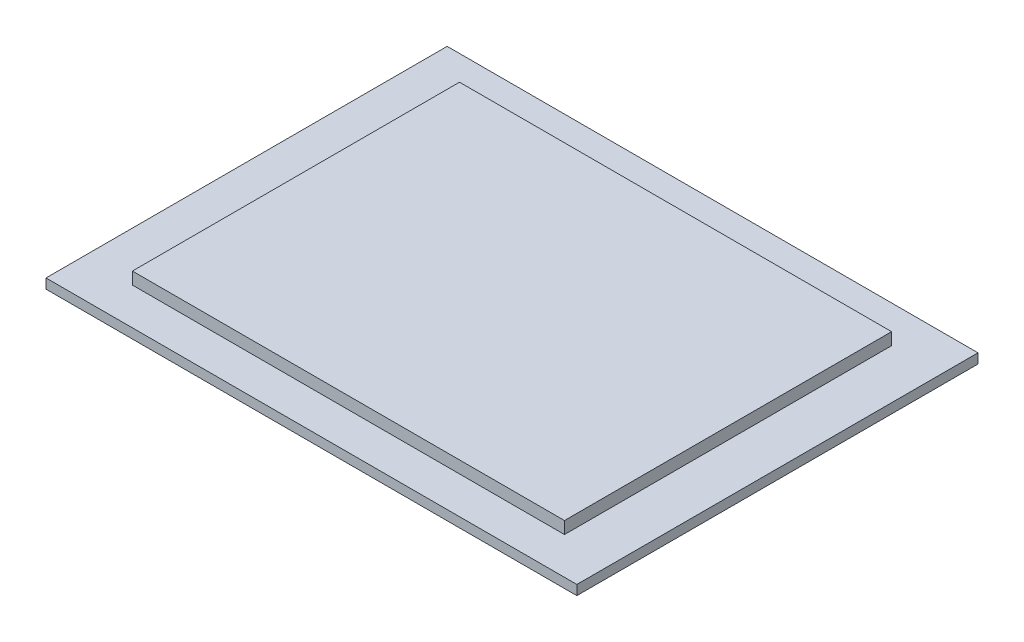
ISO-10303-21;
HEADER;
FILE_DESCRIPTION(('STEP AP214'),'2;1');
FILE_NAME('part.step','',(''),(''),'','','');
FILE_SCHEMA(('AUTOMOTIVE_DESIGN { 1 0 10303 214 1 1 1 1 }'));
ENDSEC;
DATA;
#1=APPLICATION_CONTEXT('core data for automotive mechanical design processes');
#2=APPLICATION_PROTOCOL_DEFINITION('international standard','automotive_design',2000,#1);
#3=PRODUCT_CONTEXT('',#1,'mechanical');
#4=PRODUCT('Part','Part','',(#3));
#5=PRODUCT_RELATED_PRODUCT_CATEGORY('part','',(#4));
#6=PRODUCT_DEFINITION_FORMATION('','',#4);
#7=PRODUCT_DEFINITION_CONTEXT('part definition',#1,'design');
#8=PRODUCT_DEFINITION('design','',#6,#7);
#9=PRODUCT_DEFINITION_SHAPE('','',#8);
#10=(LENGTH_UNIT() NAMED_UNIT(*) SI_UNIT(.MILLI.,.METRE.));
#11=(NAMED_UNIT(*) PLANE_ANGLE_UNIT() SI_UNIT($,.RADIAN.));
#12=(NAMED_UNIT(*) SI_UNIT($,.STERADIAN.) SOLID_ANGLE_UNIT());
#13=UNCERTAINTY_MEASURE_WITH_UNIT(LENGTH_MEASURE(1.E-05),#10,'distance_accuracy_value','');
#14=(GEOMETRIC_REPRESENTATION_CONTEXT(3) GLOBAL_UNCERTAINTY_ASSIGNED_CONTEXT((#13)) GLOBAL_UNIT_ASSIGNED_CONTEXT((#10,
#11,#12)) REPRESENTATION_CONTEXT('',''));
#15=CARTESIAN_POINT('',(0.,0.,0.));
#16=DIRECTION('',(0.,0.,1.));
#17=DIRECTION('',(1.,0.,0.));
#18=AXIS2_PLACEMENT_3D('',#15,#16,#17);
#19=CARTESIAN_POINT('',(0.,0.8,32.));
#20=DIRECTION('',(0.,1.,0.));
#21=DIRECTION('',(0.,0.,1.));
#22=AXIS2_PLACEMENT_3D('',#19,#20,#21);
#23=PLANE('',#22);
#24=DIRECTION('',(0.,0.,1.));
#25=VECTOR('',#24,1.);
#26=CARTESIAN_POINT('',(-0.5,0.8,0.));
#27=LINE('',#26,#25);
#28=CARTESIAN_POINT('',(-0.5,0.8,-0.5));
#29=VERTEX_POINT('',#28);
#30=CARTESIAN_POINT('',(-0.499999999999993,0.8,32.5));
#31=VERTEX_POINT('',#30);
#32=EDGE_CURVE('E116',#29,#31,#27,.T.);
#33=ORIENTED_EDGE('',*,*,#32,.T.);
#34=DIRECTION('',(1.,0.,0.));
#35=VECTOR('',#34,1.);
#36=CARTESIAN_POINT('',(0.,0.8,32.5));
#37=LINE('',#36,#35);
#38=CARTESIAN_POINT('',(43.167,0.8,32.5));
#39=VERTEX_POINT('',#38);
#40=EDGE_CURVE('E98',#31,#39,#37,.T.);
#41=ORIENTED_EDGE('',*,*,#40,.T.);
#42=DIRECTION('',(0.,0.,-1.));
#43=VECTOR('',#42,1.);
#44=CARTESIAN_POINT('',(43.167,0.8,0.));
#45=LINE('',#44,#43);
#46=CARTESIAN_POINT('',(43.167,0.8,-0.5));
#47=VERTEX_POINT('',#46);
#48=EDGE_CURVE('E293',#39,#47,#45,.T.);
#49=ORIENTED_EDGE('',*,*,#48,.T.);
#50=DIRECTION('',(-1.,0.,0.));
#51=VECTOR('',#50,1.);
#52=CARTESIAN_POINT('',(0.,0.8,-0.5));
#53=LINE('',#52,#51);
#54=EDGE_CURVE('E126',#47,#29,#53,.T.);
#55=ORIENTED_EDGE('',*,*,#54,.T.);
#56=EDGE_LOOP('',(#33,#41,#49,#55));
#57=FACE_BOUND('',#56,.T.);
#58=DIRECTION('',(1.,0.,0.));
#59=VECTOR('',#58,1.);
#60=CARTESIAN_POINT('',(4.06150000000001,0.8,29.454));
#61=LINE('',#60,#59);
#62=CARTESIAN_POINT('',(3.56150000000001,0.8,29.454));
#63=VERTEX_POINT('',#62);
#64=CARTESIAN_POINT('',(39.1055,0.8,29.454));
#65=VERTEX_POINT('',#64);
#66=EDGE_CURVE('E166',#63,#65,#61,.T.);
#67=ORIENTED_EDGE('',*,*,#66,.F.);
#68=DIRECTION('',(0.,0.,1.));
#69=VECTOR('',#68,1.);
#70=CARTESIAN_POINT('',(3.56150000000001,0.8,3.046));
#71=LINE('',#70,#69);
#72=CARTESIAN_POINT('',(3.56150000000001,0.8,2.546));
#73=VERTEX_POINT('',#72);
#74=EDGE_CURVE('E158',#73,#63,#71,.T.);
#75=ORIENTED_EDGE('',*,*,#74,.F.);
#76=DIRECTION('',(-1.,0.,0.));
#77=VECTOR('',#76,1.);
#78=CARTESIAN_POINT('',(4.06150000000001,0.8,2.546));
#79=LINE('',#78,#77);
#80=CARTESIAN_POINT('',(39.1055,0.8,2.546));
#81=VERTEX_POINT('',#80);
#82=EDGE_CURVE('E135',#81,#73,#79,.T.);
#83=ORIENTED_EDGE('',*,*,#82,.F.);
#84=DIRECTION('',(0.,0.,-1.));
#85=VECTOR('',#84,1.);
#86=CARTESIAN_POINT('',(39.1055,0.8,3.046));
#87=LINE('',#86,#85);
#88=EDGE_CURVE('E297',#65,#81,#87,.T.);
#89=ORIENTED_EDGE('',*,*,#88,.F.);
#90=EDGE_LOOP('',(#67,#75,#83,#89));
#91=FACE_BOUND('',#90,.T.);
#92=ADVANCED_FACE('F31',(#57,#91),#23,.T.);
#93=CARTESIAN_POINT('',(-0.5,0.3,0.));
#94=DIRECTION('',(1.,0.,0.));
#95=DIRECTION('',(0.,0.,-1.));
#96=AXIS2_PLACEMENT_3D('',#93,#94,#95);
#97=PLANE('',#96);
#98=DIRECTION('',(0.,0.,1.));
#99=VECTOR('',#98,1.);
#100=CARTESIAN_POINT('',(-0.5,0.,0.));
#101=LINE('',#100,#99);
#102=CARTESIAN_POINT('',(-0.5,0.,-0.5));
#103=VERTEX_POINT('',#102);
#104=CARTESIAN_POINT('',(-0.499999999999993,0.,32.5));
#105=VERTEX_POINT('',#104);
#106=EDGE_CURVE('E89',#103,#105,#101,.T.);
#107=ORIENTED_EDGE('',*,*,#106,.T.);
#108=DIRECTION('',(0.,-1.,0.));
#109=VECTOR('',#108,1.);
#110=CARTESIAN_POINT('',(-0.499999999999993,0.3,32.5));
#111=LINE('',#110,#109);
#112=EDGE_CURVE('E11',#31,#105,#111,.T.);
#113=ORIENTED_EDGE('',*,*,#112,.F.);
#114=ORIENTED_EDGE('',*,*,#32,.F.);
#115=DIRECTION('',(0.,-1.,0.));
#116=VECTOR('',#115,1.);
#117=CARTESIAN_POINT('',(-0.5,0.3,-0.5));
#118=LINE('',#117,#116);
#119=EDGE_CURVE('E105',#29,#103,#118,.T.);
#120=ORIENTED_EDGE('',*,*,#119,.T.);
#121=EDGE_LOOP('',(#107,#113,#114,#120));
#122=FACE_BOUND('',#121,.T.);
#123=ADVANCED_FACE('F103',(#122),#97,.F.);
#124=CARTESIAN_POINT('',(0.,0.3,32.5));
#125=DIRECTION('',(0.,0.,-1.));
#126=DIRECTION('',(-1.,0.,0.));
#127=AXIS2_PLACEMENT_3D('',#124,#125,#126);
#128=PLANE('',#127);
#129=DIRECTION('',(1.,0.,0.));
#130=VECTOR('',#129,1.);
#131=CARTESIAN_POINT('',(0.,0.,32.5));
#132=LINE('',#131,#130);
#133=CARTESIAN_POINT('',(43.167,0.,32.5));
#134=VERTEX_POINT('',#133);
#135=EDGE_CURVE('E35',#105,#134,#132,.T.);
#136=ORIENTED_EDGE('',*,*,#135,.T.);
#137=DIRECTION('',(0.,-1.,0.));
#138=VECTOR('',#137,1.);
#139=CARTESIAN_POINT('',(43.167,0.3,32.5));
#140=LINE('',#139,#138);
#141=EDGE_CURVE('E40',#39,#134,#140,.T.);
#142=ORIENTED_EDGE('',*,*,#141,.F.);
#143=ORIENTED_EDGE('',*,*,#40,.F.);
#144=ORIENTED_EDGE('',*,*,#112,.T.);
#145=EDGE_LOOP('',(#136,#142,#143,#144));
#146=FACE_BOUND('',#145,.T.);
#147=ADVANCED_FACE('F96',(#146),#128,.F.);
#148=CARTESIAN_POINT('',(43.167,0.3,0.));
#149=DIRECTION('',(-1.,0.,0.));
#150=DIRECTION('',(0.,0.,1.));
#151=AXIS2_PLACEMENT_3D('',#148,#149,#150);
#152=PLANE('',#151);
#153=DIRECTION('',(0.,0.,-1.));
#154=VECTOR('',#153,1.);
#155=CARTESIAN_POINT('',(43.167,0.,0.));
#156=LINE('',#155,#154);
#157=CARTESIAN_POINT('',(43.167,0.,-0.5));
#158=VERTEX_POINT('',#157);
#159=EDGE_CURVE('E90',#134,#158,#156,.T.);
#160=ORIENTED_EDGE('',*,*,#159,.T.);
#161=DIRECTION('',(0.,-1.,0.));
#162=VECTOR('',#161,1.);
#163=CARTESIAN_POINT('',(43.167,0.3,-0.5));
#164=LINE('',#163,#162);
#165=EDGE_CURVE('E122',#47,#158,#164,.T.);
#166=ORIENTED_EDGE('',*,*,#165,.F.);
#167=ORIENTED_EDGE('',*,*,#48,.F.);
#168=ORIENTED_EDGE('',*,*,#141,.T.);
#169=EDGE_LOOP('',(#160,#166,#167,#168));
#170=FACE_BOUND('',#169,.T.);
#171=ADVANCED_FACE('F120',(#170),#152,.F.);
#172=CARTESIAN_POINT('',(0.,0.3,-0.5));
#173=DIRECTION('',(0.,0.,1.));
#174=DIRECTION('',(1.,0.,0.));
#175=AXIS2_PLACEMENT_3D('',#172,#173,#174);
#176=PLANE('',#175);
#177=DIRECTION('',(-1.,0.,0.));
#178=VECTOR('',#177,1.);
#179=CARTESIAN_POINT('',(0.,0.,-0.5));
#180=LINE('',#179,#178);
#181=EDGE_CURVE('E115',#158,#103,#180,.T.);
#182=ORIENTED_EDGE('',*,*,#181,.T.);
#183=ORIENTED_EDGE('',*,*,#119,.F.);
#184=ORIENTED_EDGE('',*,*,#54,.F.);
#185=ORIENTED_EDGE('',*,*,#165,.T.);
#186=EDGE_LOOP('',(#182,#183,#184,#185));
#187=FACE_BOUND('',#186,.T.);
#188=ADVANCED_FACE('F125',(#187),#176,.F.);
#189=CARTESIAN_POINT('',(0.,0.,32.));
#190=DIRECTION('',(0.,1.,0.));
#191=DIRECTION('',(0.,0.,1.));
#192=AXIS2_PLACEMENT_3D('',#189,#190,#191);
#193=PLANE('',#192);
#194=DIRECTION('',(-1.,0.,0.));
#195=VECTOR('',#194,1.);
#196=CARTESIAN_POINT('',(0.,0.,0.));
#197=LINE('',#196,#195);
#198=CARTESIAN_POINT('',(42.667,0.,0.));
#199=VERTEX_POINT('',#198);
#200=CARTESIAN_POINT('',(0.,0.,0.));
#201=VERTEX_POINT('',#200);
#202=EDGE_CURVE('E270',#199,#201,#197,.T.);
#203=ORIENTED_EDGE('',*,*,#202,.T.);
#204=DIRECTION('',(0.,0.,1.));
#205=VECTOR('',#204,1.);
#206=CARTESIAN_POINT('',(0.,0.,0.));
#207=LINE('',#206,#205);
#208=CARTESIAN_POINT('',(0.,0.,32.));
#209=VERTEX_POINT('',#208);
#210=EDGE_CURVE('E232',#201,#209,#207,.T.);
#211=ORIENTED_EDGE('',*,*,#210,.T.);
#212=DIRECTION('',(1.,0.,0.));
#213=VECTOR('',#212,1.);
#214=CARTESIAN_POINT('',(0.,0.,32.));
#215=LINE('',#214,#213);
#216=CARTESIAN_POINT('',(42.667,0.,32.));
#217=VERTEX_POINT('',#216);
#218=EDGE_CURVE('E266',#209,#217,#215,.T.);
#219=ORIENTED_EDGE('',*,*,#218,.T.);
#220=DIRECTION('',(0.,0.,-1.));
#221=VECTOR('',#220,1.);
#222=CARTESIAN_POINT('',(42.667,0.,0.));
#223=LINE('',#222,#221);
#224=EDGE_CURVE('E48',#217,#199,#223,.T.);
#225=ORIENTED_EDGE('',*,*,#224,.T.);
#226=EDGE_LOOP('',(#203,#211,#219,#225));
#227=FACE_BOUND('',#226,.T.);
#228=ORIENTED_EDGE('',*,*,#106,.F.);
#229=ORIENTED_EDGE('',*,*,#181,.F.);
#230=ORIENTED_EDGE('',*,*,#159,.F.);
#231=ORIENTED_EDGE('',*,*,#135,.F.);
#232=EDGE_LOOP('',(#228,#229,#230,#231));
#233=FACE_BOUND('',#232,.T.);
#234=ADVANCED_FACE('F86',(#227,#233),#193,.F.);
#235=CARTESIAN_POINT('',(3.56150000000001,1.3,3.046));
#236=DIRECTION('',(1.,0.,0.));
#237=DIRECTION('',(0.,0.,-1.));
#238=AXIS2_PLACEMENT_3D('',#235,#236,#237);
#239=PLANE('',#238);
#240=ORIENTED_EDGE('',*,*,#74,.T.);
#241=DIRECTION('',(0.,-1.,0.));
#242=VECTOR('',#241,1.);
#243=CARTESIAN_POINT('',(3.56150000000001,1.3,29.454));
#244=LINE('',#243,#242);
#245=CARTESIAN_POINT('',(3.56150000000001,1.8,29.454));
#246=VERTEX_POINT('',#245);
#247=EDGE_CURVE('E106',#246,#63,#244,.T.);
#248=ORIENTED_EDGE('',*,*,#247,.F.);
#249=DIRECTION('',(0.,0.,1.));
#250=VECTOR('',#249,1.);
#251=CARTESIAN_POINT('',(3.56150000000001,1.8,3.046));
#252=LINE('',#251,#250);
#253=CARTESIAN_POINT('',(3.56150000000001,1.8,2.546));
#254=VERTEX_POINT('',#253);
#255=EDGE_CURVE('E131',#254,#246,#252,.T.);
#256=ORIENTED_EDGE('',*,*,#255,.F.);
#257=DIRECTION('',(0.,-1.,0.));
#258=VECTOR('',#257,1.);
#259=CARTESIAN_POINT('',(3.56150000000001,1.3,2.546));
#260=LINE('',#259,#258);
#261=EDGE_CURVE('E136',#254,#73,#260,.T.);
#262=ORIENTED_EDGE('',*,*,#261,.T.);
#263=EDGE_LOOP('',(#240,#248,#256,#262));
#264=FACE_BOUND('',#263,.T.);
#265=ADVANCED_FACE('F156',(#264),#239,.F.);
#266=CARTESIAN_POINT('',(4.06150000000001,1.3,29.454));
#267=DIRECTION('',(0.,0.,-1.));
#268=DIRECTION('',(-1.,0.,0.));
#269=AXIS2_PLACEMENT_3D('',#266,#267,#268);
#270=PLANE('',#269);
#271=ORIENTED_EDGE('',*,*,#66,.T.);
#272=DIRECTION('',(0.,-1.,0.));
#273=VECTOR('',#272,1.);
#274=CARTESIAN_POINT('',(39.1055,1.3,29.454));
#275=LINE('',#274,#273);
#276=CARTESIAN_POINT('',(39.1055,1.8,29.454));
#277=VERTEX_POINT('',#276);
#278=EDGE_CURVE('E109',#277,#65,#275,.T.);
#279=ORIENTED_EDGE('',*,*,#278,.F.);
#280=DIRECTION('',(1.,0.,0.));
#281=VECTOR('',#280,1.);
#282=CARTESIAN_POINT('',(4.06150000000001,1.8,29.454));
#283=LINE('',#282,#281);
#284=EDGE_CURVE('E134',#246,#277,#283,.T.);
#285=ORIENTED_EDGE('',*,*,#284,.F.);
#286=ORIENTED_EDGE('',*,*,#247,.T.);
#287=EDGE_LOOP('',(#271,#279,#285,#286));
#288=FACE_BOUND('',#287,.T.);
#289=ADVANCED_FACE('F163',(#288),#270,.F.);
#290=CARTESIAN_POINT('',(39.1055,1.3,3.046));
#291=DIRECTION('',(-1.,0.,0.));
#292=DIRECTION('',(0.,0.,1.));
#293=AXIS2_PLACEMENT_3D('',#290,#291,#292);
#294=PLANE('',#293);
#295=ORIENTED_EDGE('',*,*,#88,.T.);
#296=DIRECTION('',(0.,-1.,0.));
#297=VECTOR('',#296,1.);
#298=CARTESIAN_POINT('',(39.1055,1.3,2.546));
#299=LINE('',#298,#297);
#300=CARTESIAN_POINT('',(39.1055,1.8,2.546));
#301=VERTEX_POINT('',#300);
#302=EDGE_CURVE('E57',#301,#81,#299,.T.);
#303=ORIENTED_EDGE('',*,*,#302,.F.);
#304=DIRECTION('',(0.,0.,-1.));
#305=VECTOR('',#304,1.);
#306=CARTESIAN_POINT('',(39.1055,1.8,3.046));
#307=LINE('',#306,#305);
#308=EDGE_CURVE('E143',#277,#301,#307,.T.);
#309=ORIENTED_EDGE('',*,*,#308,.F.);
#310=ORIENTED_EDGE('',*,*,#278,.T.);
#311=EDGE_LOOP('',(#295,#303,#309,#310));
#312=FACE_BOUND('',#311,.T.);
#313=ADVANCED_FACE('F302',(#312),#294,.F.);
#314=CARTESIAN_POINT('',(4.06150000000001,1.3,2.546));
#315=DIRECTION('',(0.,0.,1.));
#316=DIRECTION('',(1.,0.,0.));
#317=AXIS2_PLACEMENT_3D('',#314,#315,#316);
#318=PLANE('',#317);
#319=ORIENTED_EDGE('',*,*,#82,.T.);
#320=ORIENTED_EDGE('',*,*,#261,.F.);
#321=DIRECTION('',(-1.,0.,0.));
#322=VECTOR('',#321,1.);
#323=CARTESIAN_POINT('',(4.06150000000001,1.8,2.546));
#324=LINE('',#323,#322);
#325=EDGE_CURVE('E113',#301,#254,#324,.T.);
#326=ORIENTED_EDGE('',*,*,#325,.F.);
#327=ORIENTED_EDGE('',*,*,#302,.T.);
#328=EDGE_LOOP('',(#319,#320,#326,#327));
#329=FACE_BOUND('',#328,.T.);
#330=ADVANCED_FACE('F150',(#329),#318,.F.);
#331=CARTESIAN_POINT('',(4.06150000000001,1.8,28.954));
#332=DIRECTION('',(0.,1.,0.));
#333=DIRECTION('',(0.,0.,1.));
#334=AXIS2_PLACEMENT_3D('',#331,#332,#333);
#335=PLANE('',#334);
#336=ORIENTED_EDGE('',*,*,#255,.T.);
#337=ORIENTED_EDGE('',*,*,#284,.T.);
#338=ORIENTED_EDGE('',*,*,#308,.T.);
#339=ORIENTED_EDGE('',*,*,#325,.T.);
#340=EDGE_LOOP('',(#336,#337,#338,#339));
#341=FACE_BOUND('',#340,.T.);
#342=ADVANCED_FACE('F33',(#341),#335,.T.);
#343=CARTESIAN_POINT('',(0.,0.3,32.));
#344=DIRECTION('',(0.,1.,0.));
#345=DIRECTION('',(0.,0.,1.));
#346=AXIS2_PLACEMENT_3D('',#343,#344,#345);
#347=PLANE('',#346);
#348=DIRECTION('',(0.,0.,1.));
#349=VECTOR('',#348,1.);
#350=CARTESIAN_POINT('',(0.,0.3,0.));
#351=LINE('',#350,#349);
#352=CARTESIAN_POINT('',(0.,0.3,0.));
#353=VERTEX_POINT('',#352);
#354=CARTESIAN_POINT('',(0.,0.3,32.));
#355=VERTEX_POINT('',#354);
#356=EDGE_CURVE('E273',#353,#355,#351,.T.);
#357=ORIENTED_EDGE('',*,*,#356,.F.);
#358=DIRECTION('',(-1.,0.,0.));
#359=VECTOR('',#358,1.);
#360=CARTESIAN_POINT('',(0.,0.3,0.));
#361=LINE('',#360,#359);
#362=CARTESIAN_POINT('',(42.667,0.3,0.));
#363=VERTEX_POINT('',#362);
#364=EDGE_CURVE('E280',#363,#353,#361,.T.);
#365=ORIENTED_EDGE('',*,*,#364,.F.);
#366=DIRECTION('',(0.,0.,-1.));
#367=VECTOR('',#366,1.);
#368=CARTESIAN_POINT('',(42.667,0.3,0.));
#369=LINE('',#368,#367);
#370=CARTESIAN_POINT('',(42.667,0.3,32.));
#371=VERTEX_POINT('',#370);
#372=EDGE_CURVE('E278',#371,#363,#369,.T.);
#373=ORIENTED_EDGE('',*,*,#372,.F.);
#374=DIRECTION('',(1.,0.,0.));
#375=VECTOR('',#374,1.);
#376=CARTESIAN_POINT('',(0.,0.3,32.));
#377=LINE('',#376,#375);
#378=EDGE_CURVE('E276',#355,#371,#377,.T.);
#379=ORIENTED_EDGE('',*,*,#378,.F.);
#380=EDGE_LOOP('',(#357,#365,#373,#379));
#381=FACE_BOUND('',#380,.T.);
#382=DIRECTION('',(1.,0.,0.));
#383=VECTOR('',#382,1.);
#384=CARTESIAN_POINT('',(4.06150000000001,0.3,28.954));
#385=LINE('',#384,#383);
#386=CARTESIAN_POINT('',(4.06150000000001,0.3,28.954));
#387=VERTEX_POINT('',#386);
#388=CARTESIAN_POINT('',(38.6055,0.3,28.954));
#389=VERTEX_POINT('',#388);
#390=EDGE_CURVE('E238',#387,#389,#385,.T.);
#391=ORIENTED_EDGE('',*,*,#390,.T.);
#392=DIRECTION('',(0.,0.,-1.));
#393=VECTOR('',#392,1.);
#394=CARTESIAN_POINT('',(38.6055,0.3,3.046));
#395=LINE('',#394,#393);
#396=CARTESIAN_POINT('',(38.6055,0.3,3.046));
#397=VERTEX_POINT('',#396);
#398=EDGE_CURVE('E247',#389,#397,#395,.T.);
#399=ORIENTED_EDGE('',*,*,#398,.T.);
#400=DIRECTION('',(-1.,0.,0.));
#401=VECTOR('',#400,1.);
#402=CARTESIAN_POINT('',(4.06150000000001,0.3,3.046));
#403=LINE('',#402,#401);
#404=CARTESIAN_POINT('',(4.06150000000001,0.3,3.046));
#405=VERTEX_POINT('',#404);
#406=EDGE_CURVE('E241',#397,#405,#403,.T.);
#407=ORIENTED_EDGE('',*,*,#406,.T.);
#408=DIRECTION('',(0.,0.,1.));
#409=VECTOR('',#408,1.);
#410=CARTESIAN_POINT('',(4.06150000000001,0.3,3.046));
#411=LINE('',#410,#409);
#412=EDGE_CURVE('E227',#405,#387,#411,.T.);
#413=ORIENTED_EDGE('',*,*,#412,.T.);
#414=EDGE_LOOP('',(#391,#399,#407,#413));
#415=FACE_BOUND('',#414,.T.);
#416=ADVANCED_FACE('F236',(#381,#415),#347,.F.);
#417=CARTESIAN_POINT('',(0.,0.3,0.));
#418=DIRECTION('',(1.,0.,0.));
#419=DIRECTION('',(0.,0.,-1.));
#420=AXIS2_PLACEMENT_3D('',#417,#418,#419);
#421=PLANE('',#420);
#422=ORIENTED_EDGE('',*,*,#210,.F.);
#423=DIRECTION('',(0.,-1.,0.));
#424=VECTOR('',#423,1.);
#425=CARTESIAN_POINT('',(0.,0.3,0.));
#426=LINE('',#425,#424);
#427=EDGE_CURVE('E282',#353,#201,#426,.T.);
#428=ORIENTED_EDGE('',*,*,#427,.F.);
#429=ORIENTED_EDGE('',*,*,#356,.T.);
#430=DIRECTION('',(0.,-1.,0.));
#431=VECTOR('',#430,1.);
#432=CARTESIAN_POINT('',(0.,0.3,32.));
#433=LINE('',#432,#431);
#434=EDGE_CURVE('E288',#355,#209,#433,.T.);
#435=ORIENTED_EDGE('',*,*,#434,.T.);
#436=EDGE_LOOP('',(#422,#428,#429,#435));
#437=FACE_BOUND('',#436,.T.);
#438=ADVANCED_FACE('F332',(#437),#421,.T.);
#439=CARTESIAN_POINT('',(0.,0.3,32.));
#440=DIRECTION('',(0.,0.,-1.));
#441=DIRECTION('',(-1.,0.,0.));
#442=AXIS2_PLACEMENT_3D('',#439,#440,#441);
#443=PLANE('',#442);
#444=ORIENTED_EDGE('',*,*,#218,.F.);
#445=ORIENTED_EDGE('',*,*,#434,.F.);
#446=ORIENTED_EDGE('',*,*,#378,.T.);
#447=DIRECTION('',(0.,-1.,0.));
#448=VECTOR('',#447,1.);
#449=CARTESIAN_POINT('',(42.667,0.3,32.));
#450=LINE('',#449,#448);
#451=EDGE_CURVE('E286',#371,#217,#450,.T.);
#452=ORIENTED_EDGE('',*,*,#451,.T.);
#453=EDGE_LOOP('',(#444,#445,#446,#452));
#454=FACE_BOUND('',#453,.T.);
#455=ADVANCED_FACE('F338',(#454),#443,.T.);
#456=CARTESIAN_POINT('',(42.667,0.3,0.));
#457=DIRECTION('',(-1.,0.,0.));
#458=DIRECTION('',(0.,0.,1.));
#459=AXIS2_PLACEMENT_3D('',#456,#457,#458);
#460=PLANE('',#459);
#461=ORIENTED_EDGE('',*,*,#224,.F.);
#462=ORIENTED_EDGE('',*,*,#451,.F.);
#463=ORIENTED_EDGE('',*,*,#372,.T.);
#464=DIRECTION('',(0.,-1.,0.));
#465=VECTOR('',#464,1.);
#466=CARTESIAN_POINT('',(42.667,0.3,0.));
#467=LINE('',#466,#465);
#468=EDGE_CURVE('E284',#363,#199,#467,.T.);
#469=ORIENTED_EDGE('',*,*,#468,.T.);
#470=EDGE_LOOP('',(#461,#462,#463,#469));
#471=FACE_BOUND('',#470,.T.);
#472=ADVANCED_FACE('F347',(#471),#460,.T.);
#473=CARTESIAN_POINT('',(0.,0.3,0.));
#474=DIRECTION('',(0.,0.,1.));
#475=DIRECTION('',(1.,0.,0.));
#476=AXIS2_PLACEMENT_3D('',#473,#474,#475);
#477=PLANE('',#476);
#478=ORIENTED_EDGE('',*,*,#202,.F.);
#479=ORIENTED_EDGE('',*,*,#468,.F.);
#480=ORIENTED_EDGE('',*,*,#364,.T.);
#481=ORIENTED_EDGE('',*,*,#427,.T.);
#482=EDGE_LOOP('',(#478,#479,#480,#481));
#483=FACE_BOUND('',#482,.T.);
#484=ADVANCED_FACE('F344',(#483),#477,.T.);
#485=CARTESIAN_POINT('',(4.06150000000001,1.3,3.046));
#486=DIRECTION('',(1.,0.,0.));
#487=DIRECTION('',(0.,0.,-1.));
#488=AXIS2_PLACEMENT_3D('',#485,#486,#487);
#489=PLANE('',#488);
#490=ORIENTED_EDGE('',*,*,#412,.F.);
#491=DIRECTION('',(0.,-1.,0.));
#492=VECTOR('',#491,1.);
#493=CARTESIAN_POINT('',(4.06150000000001,1.3,3.046));
#494=LINE('',#493,#492);
#495=CARTESIAN_POINT('',(4.06150000000001,1.3,3.046));
#496=VERTEX_POINT('',#495);
#497=EDGE_CURVE('E259',#496,#405,#494,.T.);
#498=ORIENTED_EDGE('',*,*,#497,.F.);
#499=DIRECTION('',(0.,0.,1.));
#500=VECTOR('',#499,1.);
#501=CARTESIAN_POINT('',(4.06150000000001,1.3,3.046));
#502=LINE('',#501,#500);
#503=CARTESIAN_POINT('',(4.06150000000001,1.3,28.954));
#504=VERTEX_POINT('',#503);
#505=EDGE_CURVE('E229',#496,#504,#502,.T.);
#506=ORIENTED_EDGE('',*,*,#505,.T.);
#507=DIRECTION('',(0.,-1.,0.));
#508=VECTOR('',#507,1.);
#509=CARTESIAN_POINT('',(4.06150000000001,1.3,28.954));
#510=LINE('',#509,#508);
#511=EDGE_CURVE('E223',#504,#387,#510,.T.);
#512=ORIENTED_EDGE('',*,*,#511,.T.);
#513=EDGE_LOOP('',(#490,#498,#506,#512));
#514=FACE_BOUND('',#513,.T.);
#515=ADVANCED_FACE('F225',(#514),#489,.T.);
#516=CARTESIAN_POINT('',(4.06150000000001,1.3,28.954));
#517=DIRECTION('',(0.,0.,-1.));
#518=DIRECTION('',(-1.,0.,0.));
#519=AXIS2_PLACEMENT_3D('',#516,#517,#518);
#520=PLANE('',#519);
#521=ORIENTED_EDGE('',*,*,#390,.F.);
#522=ORIENTED_EDGE('',*,*,#511,.F.);
#523=DIRECTION('',(1.,0.,0.));
#524=VECTOR('',#523,1.);
#525=CARTESIAN_POINT('',(4.06150000000001,1.3,28.954));
#526=LINE('',#525,#524);
#527=CARTESIAN_POINT('',(38.6055,1.3,28.954));
#528=VERTEX_POINT('',#527);
#529=EDGE_CURVE('E253',#504,#528,#526,.T.);
#530=ORIENTED_EDGE('',*,*,#529,.T.);
#531=DIRECTION('',(0.,-1.,0.));
#532=VECTOR('',#531,1.);
#533=CARTESIAN_POINT('',(38.6055,1.3,28.954));
#534=LINE('',#533,#532);
#535=EDGE_CURVE('E233',#528,#389,#534,.T.);
#536=ORIENTED_EDGE('',*,*,#535,.T.);
#537=EDGE_LOOP('',(#521,#522,#530,#536));
#538=FACE_BOUND('',#537,.T.);
#539=ADVANCED_FACE('F244',(#538),#520,.T.);
#540=CARTESIAN_POINT('',(38.6055,1.3,3.046));
#541=DIRECTION('',(-1.,0.,0.));
#542=DIRECTION('',(0.,0.,1.));
#543=AXIS2_PLACEMENT_3D('',#540,#541,#542);
#544=PLANE('',#543);
#545=ORIENTED_EDGE('',*,*,#398,.F.);
#546=ORIENTED_EDGE('',*,*,#535,.F.);
#547=DIRECTION('',(0.,0.,-1.));
#548=VECTOR('',#547,1.);
#549=CARTESIAN_POINT('',(38.6055,1.3,3.046));
#550=LINE('',#549,#548);
#551=CARTESIAN_POINT('',(38.6055,1.3,3.046));
#552=VERTEX_POINT('',#551);
#553=EDGE_CURVE('E255',#528,#552,#550,.T.);
#554=ORIENTED_EDGE('',*,*,#553,.T.);
#555=DIRECTION('',(0.,-1.,0.));
#556=VECTOR('',#555,1.);
#557=CARTESIAN_POINT('',(38.6055,1.3,3.046));
#558=LINE('',#557,#556);
#559=EDGE_CURVE('E261',#552,#397,#558,.T.);
#560=ORIENTED_EDGE('',*,*,#559,.T.);
#561=EDGE_LOOP('',(#545,#546,#554,#560));
#562=FACE_BOUND('',#561,.T.);
#563=ADVANCED_FACE('F430',(#562),#544,.T.);
#564=CARTESIAN_POINT('',(4.06150000000001,1.3,3.046));
#565=DIRECTION('',(0.,0.,1.));
#566=DIRECTION('',(1.,0.,0.));
#567=AXIS2_PLACEMENT_3D('',#564,#565,#566);
#568=PLANE('',#567);
#569=ORIENTED_EDGE('',*,*,#406,.F.);
#570=ORIENTED_EDGE('',*,*,#559,.F.);
#571=DIRECTION('',(-1.,0.,0.));
#572=VECTOR('',#571,1.);
#573=CARTESIAN_POINT('',(4.06150000000001,1.3,3.046));
#574=LINE('',#573,#572);
#575=EDGE_CURVE('E257',#552,#496,#574,.T.);
#576=ORIENTED_EDGE('',*,*,#575,.T.);
#577=ORIENTED_EDGE('',*,*,#497,.T.);
#578=EDGE_LOOP('',(#569,#570,#576,#577));
#579=FACE_BOUND('',#578,.T.);
#580=ADVANCED_FACE('F438',(#579),#568,.T.);
#581=CARTESIAN_POINT('',(4.06150000000001,1.3,28.954));
#582=DIRECTION('',(0.,1.,0.));
#583=DIRECTION('',(0.,0.,1.));
#584=AXIS2_PLACEMENT_3D('',#581,#582,#583);
#585=PLANE('',#584);
#586=ORIENTED_EDGE('',*,*,#505,.F.);
#587=ORIENTED_EDGE('',*,*,#575,.F.);
#588=ORIENTED_EDGE('',*,*,#553,.F.);
#589=ORIENTED_EDGE('',*,*,#529,.F.);
#590=EDGE_LOOP('',(#586,#587,#588,#589));
#591=FACE_BOUND('',#590,.T.);
#592=ADVANCED_FACE('F448',(#591),#585,.F.);
#593=CLOSED_SHELL('',(#92,#123,#147,#171,#188,#234,#265,#289,#313,#330,#342,#416,#438,#455,#472,
#484,#515,#539,#563,#580,#592));
#594=MANIFOLD_SOLID_BREP('B2',#593);
#595=ADVANCED_BREP_SHAPE_REPRESENTATION('',(#18,#594),#14);
#596=SHAPE_DEFINITION_REPRESENTATION(#9,#595);
ENDSEC;
END-ISO-10303-21;
